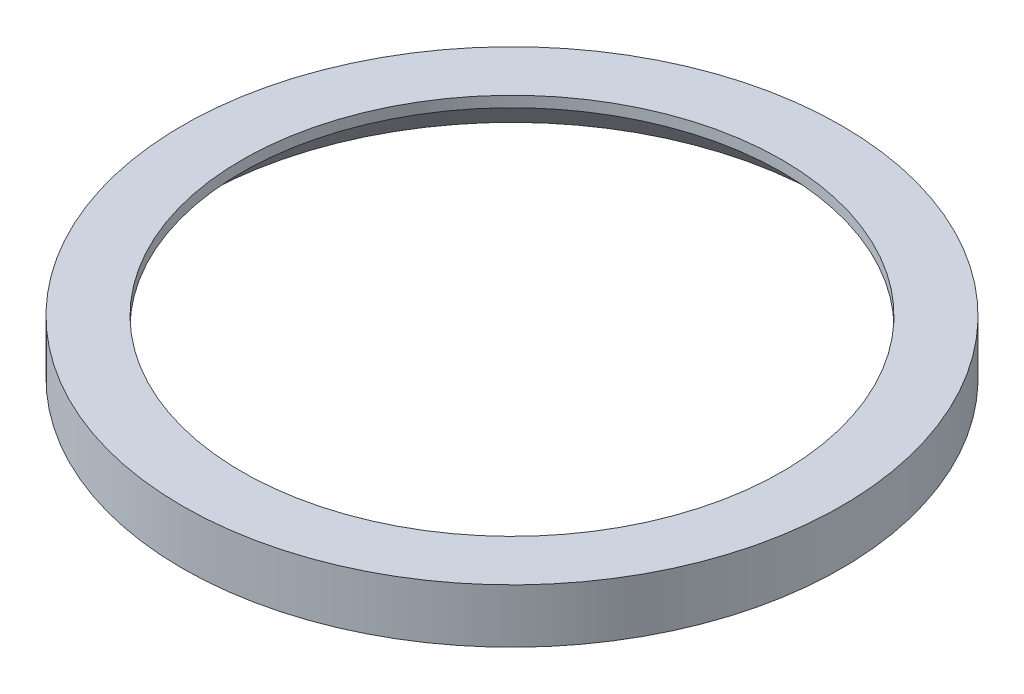
ISO-10303-21;
HEADER;
FILE_DESCRIPTION(('STEP AP214'),'2;1');
FILE_NAME('part.step','',(''),(''),'','','');
FILE_SCHEMA(('AUTOMOTIVE_DESIGN { 1 0 10303 214 1 1 1 1 }'));
ENDSEC;
DATA;
#1=APPLICATION_CONTEXT('core data for automotive mechanical design processes');
#2=APPLICATION_PROTOCOL_DEFINITION('international standard','automotive_design',2000,#1);
#3=PRODUCT_CONTEXT('',#1,'mechanical');
#4=PRODUCT('Part','Part','',(#3));
#5=PRODUCT_RELATED_PRODUCT_CATEGORY('part','',(#4));
#6=PRODUCT_DEFINITION_FORMATION('','',#4);
#7=PRODUCT_DEFINITION_CONTEXT('part definition',#1,'design');
#8=PRODUCT_DEFINITION('design','',#6,#7);
#9=PRODUCT_DEFINITION_SHAPE('','',#8);
#10=(LENGTH_UNIT() NAMED_UNIT(*) SI_UNIT(.MILLI.,.METRE.));
#11=(NAMED_UNIT(*) PLANE_ANGLE_UNIT() SI_UNIT($,.RADIAN.));
#12=(NAMED_UNIT(*) SI_UNIT($,.STERADIAN.) SOLID_ANGLE_UNIT());
#13=UNCERTAINTY_MEASURE_WITH_UNIT(LENGTH_MEASURE(1.E-05),#10,'distance_accuracy_value','');
#14=(GEOMETRIC_REPRESENTATION_CONTEXT(3) GLOBAL_UNCERTAINTY_ASSIGNED_CONTEXT((#13)) GLOBAL_UNIT_ASSIGNED_CONTEXT((#10,
#11,#12)) REPRESENTATION_CONTEXT('',''));
#15=CARTESIAN_POINT('',(0.,0.,0.));
#16=DIRECTION('',(0.,0.,1.));
#17=DIRECTION('',(1.,0.,0.));
#18=AXIS2_PLACEMENT_3D('',#15,#16,#17);
#19=CARTESIAN_POINT('',(-7.839964,0.,-7.839964));
#20=DIRECTION('',(0.,1.,0.));
#21=DIRECTION('',(0.,0.,1.));
#22=AXIS2_PLACEMENT_3D('',#19,#20,#21);
#23=PLANE('',#22);
#24=CARTESIAN_POINT('',(0.,0.,0.));
#25=DIRECTION('',(0.,-1.,0.));
#26=DIRECTION('',(0.,0.,-1.));
#27=AXIS2_PLACEMENT_3D('',#24,#25,#26);
#28=CIRCLE('',#27,6.35);
#29=CARTESIAN_POINT('',(0.,0.,-6.35));
#30=VERTEX_POINT('',#29);
#31=EDGE_CURVE('E31',#30,#30,#28,.F.);
#32=ORIENTED_EDGE('',*,*,#31,.F.);
#33=EDGE_LOOP('',(#32));
#34=FACE_BOUND('',#33,.T.);
#35=CARTESIAN_POINT('',(0.,0.,0.));
#36=DIRECTION('',(0.,-1.,0.));
#37=DIRECTION('',(0.,0.,-1.));
#38=AXIS2_PLACEMENT_3D('',#35,#36,#37);
#39=CIRCLE('',#38,7.747);
#40=CARTESIAN_POINT('',(0.,0.,-7.747));
#41=VERTEX_POINT('',#40);
#42=EDGE_CURVE('E18',#41,#41,#39,.F.);
#43=ORIENTED_EDGE('',*,*,#42,.T.);
#44=EDGE_LOOP('',(#43));
#45=FACE_BOUND('',#44,.T.);
#46=ADVANCED_FACE('F14',(#34,#45),#23,.T.);
#47=CARTESIAN_POINT('',(0.,0.,0.));
#48=DIRECTION('',(0.,-1.,0.));
#49=DIRECTION('',(0.,0.,-1.));
#50=AXIS2_PLACEMENT_3D('',#47,#48,#49);
#51=CYLINDRICAL_SURFACE('',#50,7.747);
#52=ORIENTED_EDGE('',*,*,#42,.F.);
#53=EDGE_LOOP('',(#52));
#54=FACE_BOUND('',#53,.T.);
#55=CARTESIAN_POINT('',(0.,-1.27,0.));
#56=DIRECTION('',(0.,-1.,0.));
#57=DIRECTION('',(0.,0.,-1.));
#58=AXIS2_PLACEMENT_3D('',#55,#56,#57);
#59=CIRCLE('',#58,7.747);
#60=CARTESIAN_POINT('',(0.,-1.27,-7.747));
#61=VERTEX_POINT('',#60);
#62=EDGE_CURVE('E27',#61,#61,#59,.T.);
#63=ORIENTED_EDGE('',*,*,#62,.F.);
#64=EDGE_LOOP('',(#63));
#65=FACE_BOUND('',#64,.T.);
#66=ADVANCED_FACE('F39',(#54,#65),#51,.T.);
#67=CARTESIAN_POINT('',(0.,0.,0.));
#68=DIRECTION('',(0.,-1.,0.));
#69=DIRECTION('',(0.,0.,-1.));
#70=AXIS2_PLACEMENT_3D('',#67,#68,#69);
#71=CYLINDRICAL_SURFACE('',#70,6.35);
#72=ORIENTED_EDGE('',*,*,#31,.T.);
#73=EDGE_LOOP('',(#72));
#74=FACE_BOUND('',#73,.T.);
#75=CARTESIAN_POINT('',(0.,-0.253999999999976,0.));
#76=DIRECTION('',(0.,-1.,0.));
#77=DIRECTION('',(0.,0.,-1.));
#78=AXIS2_PLACEMENT_3D('',#75,#76,#77);
#79=CIRCLE('',#78,6.35);
#80=CARTESIAN_POINT('',(0.,-0.254,-6.35));
#81=VERTEX_POINT('',#80);
#82=EDGE_CURVE('E22',#81,#81,#79,.F.);
#83=ORIENTED_EDGE('',*,*,#82,.F.);
#84=EDGE_LOOP('',(#83));
#85=FACE_BOUND('',#84,.T.);
#86=ADVANCED_FACE('F42',(#74,#85),#71,.F.);
#87=CARTESIAN_POINT('',(-7.839964,-1.27,7.839964));
#88=DIRECTION('',(0.,-1.,0.));
#89=DIRECTION('',(0.,0.,-1.));
#90=AXIS2_PLACEMENT_3D('',#87,#88,#89);
#91=PLANE('',#90);
#92=CARTESIAN_POINT('',(0.,-1.26999999999999,0.));
#93=DIRECTION('',(0.,-1.,0.));
#94=DIRECTION('',(1.,0.,0.));
#95=AXIS2_PLACEMENT_3D('',#92,#93,#94);
#96=CIRCLE('',#95,7.366);
#97=CARTESIAN_POINT('',(7.366,-1.26999999999999,0.));
#98=VERTEX_POINT('',#97);
#99=EDGE_CURVE('E10',#98,#98,#96,.T.);
#100=ORIENTED_EDGE('',*,*,#99,.F.);
#101=EDGE_LOOP('',(#100));
#102=FACE_BOUND('',#101,.T.);
#103=ORIENTED_EDGE('',*,*,#62,.T.);
#104=EDGE_LOOP('',(#103));
#105=FACE_BOUND('',#104,.T.);
#106=ADVANCED_FACE('F16',(#102,#105),#91,.T.);
#107=CARTESIAN_POINT('',(0.,-0.254,0.));
#108=DIRECTION('',(0.,-1.,0.));
#109=DIRECTION('',(1.,0.,0.));
#110=AXIS2_PLACEMENT_3D('',#107,#108,#109);
#111=CONICAL_SURFACE('',#110,6.35,0.785398163397449);
#112=ORIENTED_EDGE('',*,*,#82,.T.);
#113=EDGE_LOOP('',(#112));
#114=FACE_BOUND('',#113,.T.);
#115=ORIENTED_EDGE('',*,*,#99,.T.);
#116=EDGE_LOOP('',(#115));
#117=FACE_BOUND('',#116,.T.);
#118=ADVANCED_FACE('F47',(#114,#117),#111,.F.);
#119=CLOSED_SHELL('',(#46,#66,#86,#106,#118));
#120=MANIFOLD_SOLID_BREP('B1',#119);
#121=ADVANCED_BREP_SHAPE_REPRESENTATION('',(#18,#120),#14);
#122=SHAPE_DEFINITION_REPRESENTATION(#9,#121);
ENDSEC;
END-ISO-10303-21;
